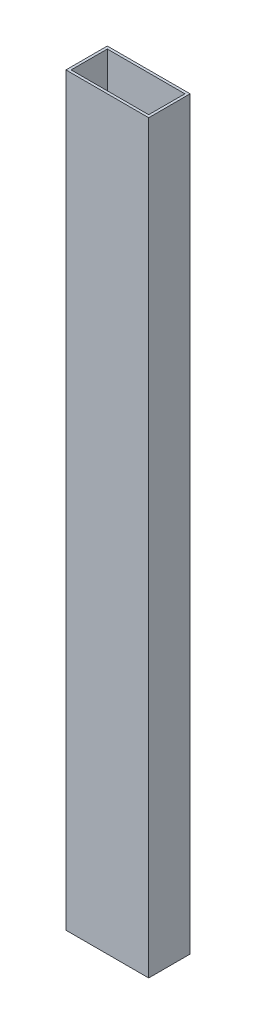
ISO-10303-21;
HEADER;
FILE_DESCRIPTION(('STEP AP214'),'2;1');
FILE_NAME('part.step','',(''),(''),'','','');
FILE_SCHEMA(('AUTOMOTIVE_DESIGN { 1 0 10303 214 1 1 1 1 }'));
ENDSEC;
DATA;
#1=APPLICATION_CONTEXT('core data for automotive mechanical design processes');
#2=APPLICATION_PROTOCOL_DEFINITION('international standard','automotive_design',2000,#1);
#3=PRODUCT_CONTEXT('',#1,'mechanical');
#4=PRODUCT('Part','Part','',(#3));
#5=PRODUCT_RELATED_PRODUCT_CATEGORY('part','',(#4));
#6=PRODUCT_DEFINITION_FORMATION('','',#4);
#7=PRODUCT_DEFINITION_CONTEXT('part definition',#1,'design');
#8=PRODUCT_DEFINITION('design','',#6,#7);
#9=PRODUCT_DEFINITION_SHAPE('','',#8);
#10=(LENGTH_UNIT() NAMED_UNIT(*) SI_UNIT(.MILLI.,.METRE.));
#11=(NAMED_UNIT(*) PLANE_ANGLE_UNIT() SI_UNIT($,.RADIAN.));
#12=(NAMED_UNIT(*) SI_UNIT($,.STERADIAN.) SOLID_ANGLE_UNIT());
#13=UNCERTAINTY_MEASURE_WITH_UNIT(LENGTH_MEASURE(1.E-05),#10,'distance_accuracy_value','');
#14=(GEOMETRIC_REPRESENTATION_CONTEXT(3) GLOBAL_UNCERTAINTY_ASSIGNED_CONTEXT((#13)) GLOBAL_UNIT_ASSIGNED_CONTEXT((#10,
#11,#12)) REPRESENTATION_CONTEXT('',''));
#15=CARTESIAN_POINT('',(0.,0.,0.));
#16=DIRECTION('',(0.,0.,1.));
#17=DIRECTION('',(1.,0.,0.));
#18=AXIS2_PLACEMENT_3D('',#15,#16,#17);
#19=CARTESIAN_POINT('',(43.3075136125088,-228.6,19.9325561195612));
#20=DIRECTION('',(1.,0.,0.));
#21=DIRECTION('',(0.,0.,-1.));
#22=AXIS2_PLACEMENT_3D('',#19,#20,#21);
#23=PLANE('',#22);
#24=DIRECTION('',(0.,0.,-1.));
#25=VECTOR('',#24,1.);
#26=CARTESIAN_POINT('',(43.3075136125088,228.6,19.9325561195612));
#27=LINE('',#26,#25);
#28=CARTESIAN_POINT('',(43.3075136125088,228.6,19.9325561195612));
#29=VERTEX_POINT('',#28);
#30=CARTESIAN_POINT('',(43.3075136125088,228.6,-5.46744388043882));
#31=VERTEX_POINT('',#30);
#32=EDGE_CURVE('E152',#29,#31,#27,.T.);
#33=ORIENTED_EDGE('',*,*,#32,.F.);
#34=DIRECTION('',(0.,1.,0.));
#35=VECTOR('',#34,1.);
#36=CARTESIAN_POINT('',(43.3075136125088,-228.6,19.9325561195612));
#37=LINE('',#36,#35);
#38=CARTESIAN_POINT('',(43.3075136125088,-228.6,19.9325561195612));
#39=VERTEX_POINT('',#38);
#40=EDGE_CURVE('E11',#39,#29,#37,.T.);
#41=ORIENTED_EDGE('',*,*,#40,.F.);
#42=DIRECTION('',(0.,0.,-1.));
#43=VECTOR('',#42,1.);
#44=CARTESIAN_POINT('',(43.3075136125088,-228.6,19.9325561195612));
#45=LINE('',#44,#43);
#46=CARTESIAN_POINT('',(43.3075136125088,-228.6,-5.46744388043882));
#47=VERTEX_POINT('',#46);
#48=EDGE_CURVE('E158',#39,#47,#45,.T.);
#49=ORIENTED_EDGE('',*,*,#48,.T.);
#50=DIRECTION('',(0.,1.,0.));
#51=VECTOR('',#50,1.);
#52=CARTESIAN_POINT('',(43.3075136125088,-228.6,-5.46744388043882));
#53=LINE('',#52,#51);
#54=EDGE_CURVE('E46',#47,#31,#53,.T.);
#55=ORIENTED_EDGE('',*,*,#54,.T.);
#56=EDGE_LOOP('',(#33,#41,#49,#55));
#57=FACE_BOUND('',#56,.T.);
#58=ADVANCED_FACE('F43',(#57),#23,.T.);
#59=CARTESIAN_POINT('',(-7.49248638749123,-228.6,19.9325561195612));
#60=DIRECTION('',(0.,0.,1.));
#61=DIRECTION('',(1.,0.,0.));
#62=AXIS2_PLACEMENT_3D('',#59,#60,#61);
#63=PLANE('',#62);
#64=DIRECTION('',(1.,0.,0.));
#65=VECTOR('',#64,1.);
#66=CARTESIAN_POINT('',(-7.49248638749123,228.6,19.9325561195612));
#67=LINE('',#66,#65);
#68=CARTESIAN_POINT('',(-7.49248638749123,228.6,19.9325561195612));
#69=VERTEX_POINT('',#68);
#70=EDGE_CURVE('E163',#69,#29,#67,.T.);
#71=ORIENTED_EDGE('',*,*,#70,.F.);
#72=DIRECTION('',(0.,1.,0.));
#73=VECTOR('',#72,1.);
#74=CARTESIAN_POINT('',(-7.49248638749123,-228.6,19.9325561195612));
#75=LINE('',#74,#73);
#76=CARTESIAN_POINT('',(-7.49248638749123,-228.6,19.9325561195612));
#77=VERTEX_POINT('',#76);
#78=EDGE_CURVE('E52',#77,#69,#75,.T.);
#79=ORIENTED_EDGE('',*,*,#78,.F.);
#80=DIRECTION('',(1.,0.,0.));
#81=VECTOR('',#80,1.);
#82=CARTESIAN_POINT('',(-7.49248638749123,-228.6,19.9325561195612));
#83=LINE('',#82,#81);
#84=EDGE_CURVE('E171',#77,#39,#83,.T.);
#85=ORIENTED_EDGE('',*,*,#84,.T.);
#86=ORIENTED_EDGE('',*,*,#40,.T.);
#87=EDGE_LOOP('',(#71,#79,#85,#86));
#88=FACE_BOUND('',#87,.T.);
#89=ADVANCED_FACE('F205',(#88),#63,.T.);
#90=CARTESIAN_POINT('',(-7.49248638749123,-228.6,-5.46744388043881));
#91=DIRECTION('',(-1.,0.,0.));
#92=DIRECTION('',(0.,0.,1.));
#93=AXIS2_PLACEMENT_3D('',#90,#91,#92);
#94=PLANE('',#93);
#95=DIRECTION('',(0.,0.,1.));
#96=VECTOR('',#95,1.);
#97=CARTESIAN_POINT('',(-7.49248638749123,228.6,-5.46744388043881));
#98=LINE('',#97,#96);
#99=CARTESIAN_POINT('',(-7.49248638749123,228.6,-5.46744388043881));
#100=VERTEX_POINT('',#99);
#101=EDGE_CURVE('E182',#100,#69,#98,.T.);
#102=ORIENTED_EDGE('',*,*,#101,.F.);
#103=DIRECTION('',(0.,1.,0.));
#104=VECTOR('',#103,1.);
#105=CARTESIAN_POINT('',(-7.49248638749123,-228.6,-5.46744388043881));
#106=LINE('',#105,#104);
#107=CARTESIAN_POINT('',(-7.49248638749123,-228.6,-5.46744388043881));
#108=VERTEX_POINT('',#107);
#109=EDGE_CURVE('E190',#108,#100,#106,.T.);
#110=ORIENTED_EDGE('',*,*,#109,.F.);
#111=DIRECTION('',(0.,0.,1.));
#112=VECTOR('',#111,1.);
#113=CARTESIAN_POINT('',(-7.49248638749123,-228.6,-5.46744388043881));
#114=LINE('',#113,#112);
#115=EDGE_CURVE('E167',#108,#77,#114,.T.);
#116=ORIENTED_EDGE('',*,*,#115,.T.);
#117=ORIENTED_EDGE('',*,*,#78,.T.);
#118=EDGE_LOOP('',(#102,#110,#116,#117));
#119=FACE_BOUND('',#118,.T.);
#120=ADVANCED_FACE('F209',(#119),#94,.T.);
#121=CARTESIAN_POINT('',(43.3075136125088,-228.6,-5.46744388043882));
#122=DIRECTION('',(0.,0.,-1.));
#123=DIRECTION('',(-1.,0.,0.));
#124=AXIS2_PLACEMENT_3D('',#121,#122,#123);
#125=PLANE('',#124);
#126=DIRECTION('',(-1.,0.,0.));
#127=VECTOR('',#126,1.);
#128=CARTESIAN_POINT('',(43.3075136125088,228.6,-5.46744388043882));
#129=LINE('',#128,#127);
#130=EDGE_CURVE('E178',#31,#100,#129,.T.);
#131=ORIENTED_EDGE('',*,*,#130,.F.);
#132=ORIENTED_EDGE('',*,*,#54,.F.);
#133=DIRECTION('',(-1.,0.,0.));
#134=VECTOR('',#133,1.);
#135=CARTESIAN_POINT('',(43.3075136125088,-228.6,-5.46744388043882));
#136=LINE('',#135,#134);
#137=EDGE_CURVE('E162',#47,#108,#136,.T.);
#138=ORIENTED_EDGE('',*,*,#137,.T.);
#139=ORIENTED_EDGE('',*,*,#109,.T.);
#140=EDGE_LOOP('',(#131,#132,#138,#139));
#141=FACE_BOUND('',#140,.T.);
#142=ADVANCED_FACE('F200',(#141),#125,.T.);
#143=CARTESIAN_POINT('',(0.,-228.6,0.));
#144=DIRECTION('',(0.,1.,0.));
#145=DIRECTION('',(0.,0.,1.));
#146=AXIS2_PLACEMENT_3D('',#143,#144,#145);
#147=PLANE('',#146);
#148=DIRECTION('',(0.,0.,1.));
#149=VECTOR('',#148,1.);
#150=CARTESIAN_POINT('',(-5.90498638749123,-228.6,18.3450561195612));
#151=LINE('',#150,#149);
#152=CARTESIAN_POINT('',(-5.90498638749122,-228.6,-3.87994388043881));
#153=VERTEX_POINT('',#152);
#154=CARTESIAN_POINT('',(-5.90498638749123,-228.6,18.3450561195612));
#155=VERTEX_POINT('',#154);
#156=EDGE_CURVE('E118',#153,#155,#151,.T.);
#157=ORIENTED_EDGE('',*,*,#156,.T.);
#158=DIRECTION('',(1.,0.,0.));
#159=VECTOR('',#158,1.);
#160=CARTESIAN_POINT('',(41.7200136125088,-228.6,18.3450561195612));
#161=LINE('',#160,#159);
#162=CARTESIAN_POINT('',(41.7200136125088,-228.6,18.3450561195612));
#163=VERTEX_POINT('',#162);
#164=EDGE_CURVE('E111',#155,#163,#161,.T.);
#165=ORIENTED_EDGE('',*,*,#164,.T.);
#166=DIRECTION('',(0.,0.,-1.));
#167=VECTOR('',#166,1.);
#168=CARTESIAN_POINT('',(41.7200136125088,-228.6,-3.87994388043881));
#169=LINE('',#168,#167);
#170=CARTESIAN_POINT('',(41.7200136125088,-228.6,-3.87994388043881));
#171=VERTEX_POINT('',#170);
#172=EDGE_CURVE('E121',#163,#171,#169,.T.);
#173=ORIENTED_EDGE('',*,*,#172,.T.);
#174=DIRECTION('',(-1.,0.,0.));
#175=VECTOR('',#174,1.);
#176=CARTESIAN_POINT('',(-5.90498638749122,-228.6,-3.87994388043881));
#177=LINE('',#176,#175);
#178=EDGE_CURVE('E60',#171,#153,#177,.T.);
#179=ORIENTED_EDGE('',*,*,#178,.T.);
#180=EDGE_LOOP('',(#157,#165,#173,#179));
#181=FACE_BOUND('',#180,.T.);
#182=ORIENTED_EDGE('',*,*,#48,.F.);
#183=ORIENTED_EDGE('',*,*,#84,.F.);
#184=ORIENTED_EDGE('',*,*,#115,.F.);
#185=ORIENTED_EDGE('',*,*,#137,.F.);
#186=EDGE_LOOP('',(#182,#183,#184,#185));
#187=FACE_BOUND('',#186,.T.);
#188=ADVANCED_FACE('F126',(#181,#187),#147,.F.);
#189=CARTESIAN_POINT('',(0.,228.6,0.));
#190=DIRECTION('',(0.,1.,0.));
#191=DIRECTION('',(0.,0.,1.));
#192=AXIS2_PLACEMENT_3D('',#189,#190,#191);
#193=PLANE('',#192);
#194=DIRECTION('',(1.,0.,0.));
#195=VECTOR('',#194,1.);
#196=CARTESIAN_POINT('',(41.7200136125088,228.6,18.3450561195612));
#197=LINE('',#196,#195);
#198=CARTESIAN_POINT('',(-5.90498638749123,228.6,18.3450561195612));
#199=VERTEX_POINT('',#198);
#200=CARTESIAN_POINT('',(41.7200136125088,228.6,18.3450561195612));
#201=VERTEX_POINT('',#200);
#202=EDGE_CURVE('E68',#199,#201,#197,.T.);
#203=ORIENTED_EDGE('',*,*,#202,.F.);
#204=DIRECTION('',(0.,0.,1.));
#205=VECTOR('',#204,1.);
#206=CARTESIAN_POINT('',(-5.90498638749123,228.6,18.3450561195612));
#207=LINE('',#206,#205);
#208=CARTESIAN_POINT('',(-5.90498638749122,228.6,-3.87994388043881));
#209=VERTEX_POINT('',#208);
#210=EDGE_CURVE('E130',#209,#199,#207,.T.);
#211=ORIENTED_EDGE('',*,*,#210,.F.);
#212=DIRECTION('',(-1.,0.,0.));
#213=VECTOR('',#212,1.);
#214=CARTESIAN_POINT('',(-5.90498638749122,228.6,-3.87994388043881));
#215=LINE('',#214,#213);
#216=CARTESIAN_POINT('',(41.7200136125088,228.6,-3.87994388043881));
#217=VERTEX_POINT('',#216);
#218=EDGE_CURVE('E134',#217,#209,#215,.T.);
#219=ORIENTED_EDGE('',*,*,#218,.F.);
#220=DIRECTION('',(0.,0.,-1.));
#221=VECTOR('',#220,1.);
#222=CARTESIAN_POINT('',(41.7200136125088,228.6,-3.87994388043881));
#223=LINE('',#222,#221);
#224=EDGE_CURVE('E143',#201,#217,#223,.T.);
#225=ORIENTED_EDGE('',*,*,#224,.F.);
#226=EDGE_LOOP('',(#203,#211,#219,#225));
#227=FACE_BOUND('',#226,.T.);
#228=ORIENTED_EDGE('',*,*,#32,.T.);
#229=ORIENTED_EDGE('',*,*,#130,.T.);
#230=ORIENTED_EDGE('',*,*,#101,.T.);
#231=ORIENTED_EDGE('',*,*,#70,.T.);
#232=EDGE_LOOP('',(#228,#229,#230,#231));
#233=FACE_BOUND('',#232,.T.);
#234=ADVANCED_FACE('F202',(#227,#233),#193,.T.);
#235=CARTESIAN_POINT('',(41.7200136125088,-228.6,18.3450561195612));
#236=DIRECTION('',(0.,0.,1.));
#237=DIRECTION('',(1.,0.,0.));
#238=AXIS2_PLACEMENT_3D('',#235,#236,#237);
#239=PLANE('',#238);
#240=ORIENTED_EDGE('',*,*,#202,.T.);
#241=DIRECTION('',(0.,1.,0.));
#242=VECTOR('',#241,1.);
#243=CARTESIAN_POINT('',(41.7200136125088,-228.6,18.3450561195612));
#244=LINE('',#243,#242);
#245=EDGE_CURVE('E107',#163,#201,#244,.T.);
#246=ORIENTED_EDGE('',*,*,#245,.F.);
#247=ORIENTED_EDGE('',*,*,#164,.F.);
#248=DIRECTION('',(0.,1.,0.));
#249=VECTOR('',#248,1.);
#250=CARTESIAN_POINT('',(-5.90498638749123,-228.6,18.3450561195612));
#251=LINE('',#250,#249);
#252=EDGE_CURVE('E149',#155,#199,#251,.T.);
#253=ORIENTED_EDGE('',*,*,#252,.T.);
#254=EDGE_LOOP('',(#240,#246,#247,#253));
#255=FACE_BOUND('',#254,.T.);
#256=ADVANCED_FACE('F109',(#255),#239,.F.);
#257=CARTESIAN_POINT('',(-5.90498638749123,-228.6,18.3450561195612));
#258=DIRECTION('',(-1.,0.,0.));
#259=DIRECTION('',(0.,0.,1.));
#260=AXIS2_PLACEMENT_3D('',#257,#258,#259);
#261=PLANE('',#260);
#262=ORIENTED_EDGE('',*,*,#210,.T.);
#263=ORIENTED_EDGE('',*,*,#252,.F.);
#264=ORIENTED_EDGE('',*,*,#156,.F.);
#265=DIRECTION('',(0.,1.,0.));
#266=VECTOR('',#265,1.);
#267=CARTESIAN_POINT('',(-5.90498638749122,-228.6,-3.87994388043881));
#268=LINE('',#267,#266);
#269=EDGE_CURVE('E153',#153,#209,#268,.T.);
#270=ORIENTED_EDGE('',*,*,#269,.T.);
#271=EDGE_LOOP('',(#262,#263,#264,#270));
#272=FACE_BOUND('',#271,.T.);
#273=ADVANCED_FACE('F265',(#272),#261,.F.);
#274=CARTESIAN_POINT('',(-5.90498638749122,-228.6,-3.87994388043881));
#275=DIRECTION('',(0.,0.,-1.));
#276=DIRECTION('',(-1.,0.,0.));
#277=AXIS2_PLACEMENT_3D('',#274,#275,#276);
#278=PLANE('',#277);
#279=ORIENTED_EDGE('',*,*,#218,.T.);
#280=ORIENTED_EDGE('',*,*,#269,.F.);
#281=ORIENTED_EDGE('',*,*,#178,.F.);
#282=DIRECTION('',(0.,1.,0.));
#283=VECTOR('',#282,1.);
#284=CARTESIAN_POINT('',(41.7200136125088,-228.6,-3.87994388043881));
#285=LINE('',#284,#283);
#286=EDGE_CURVE('E117',#171,#217,#285,.T.);
#287=ORIENTED_EDGE('',*,*,#286,.T.);
#288=EDGE_LOOP('',(#279,#280,#281,#287));
#289=FACE_BOUND('',#288,.T.);
#290=ADVANCED_FACE('F275',(#289),#278,.F.);
#291=CARTESIAN_POINT('',(41.7200136125088,-228.6,-3.87994388043881));
#292=DIRECTION('',(1.,0.,0.));
#293=DIRECTION('',(0.,0.,-1.));
#294=AXIS2_PLACEMENT_3D('',#291,#292,#293);
#295=PLANE('',#294);
#296=ORIENTED_EDGE('',*,*,#224,.T.);
#297=ORIENTED_EDGE('',*,*,#286,.F.);
#298=ORIENTED_EDGE('',*,*,#172,.F.);
#299=ORIENTED_EDGE('',*,*,#245,.T.);
#300=EDGE_LOOP('',(#296,#297,#298,#299));
#301=FACE_BOUND('',#300,.T.);
#302=ADVANCED_FACE('F122',(#301),#295,.F.);
#303=CLOSED_SHELL('',(#58,#89,#120,#142,#188,#234,#256,#273,#290,#302));
#304=MANIFOLD_SOLID_BREP('B2',#303);
#305=ADVANCED_BREP_SHAPE_REPRESENTATION('',(#18,#304),#14);
#306=SHAPE_DEFINITION_REPRESENTATION(#9,#305);
ENDSEC;
END-ISO-10303-21;
